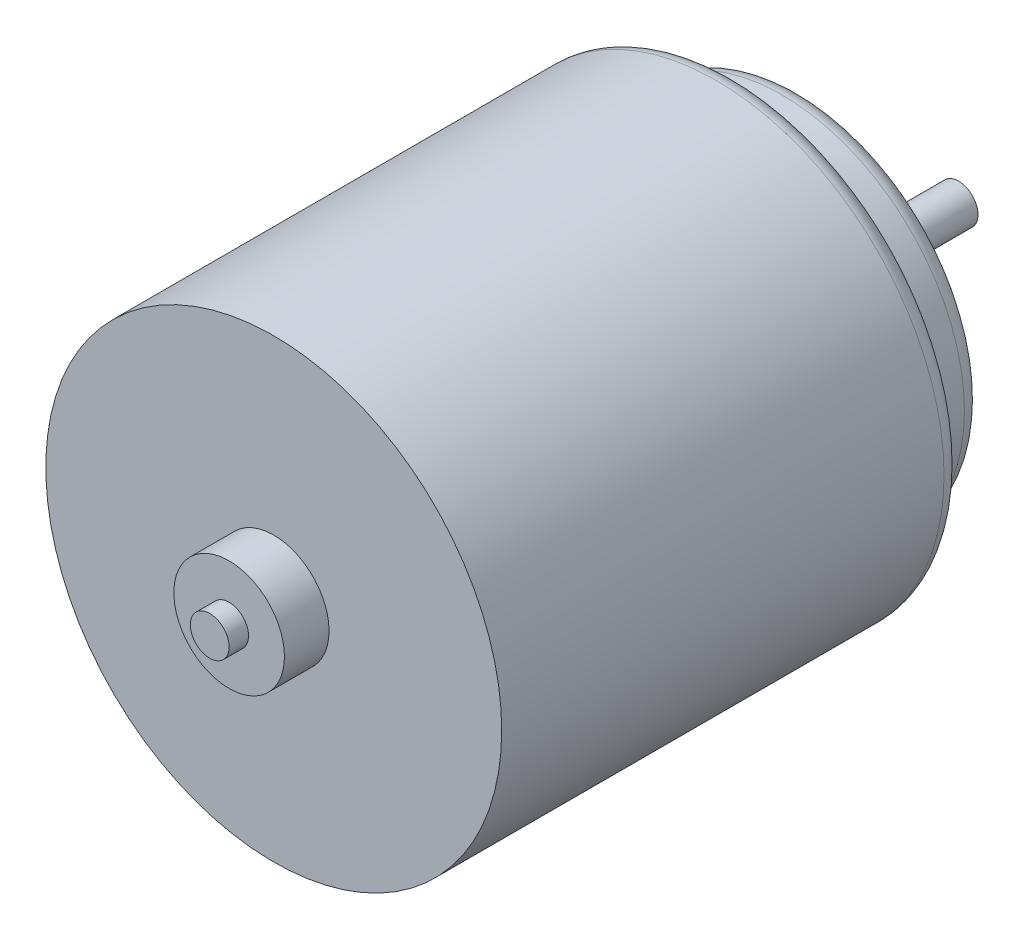
ISO-10303-21;
HEADER;
FILE_DESCRIPTION(('STEP AP214'),'2;1');
FILE_NAME('part.step','',(''),(''),'','','');
FILE_SCHEMA(('AUTOMOTIVE_DESIGN { 1 0 10303 214 1 1 1 1 }'));
ENDSEC;
DATA;
#1=APPLICATION_CONTEXT('core data for automotive mechanical design processes');
#2=APPLICATION_PROTOCOL_DEFINITION('international standard','automotive_design',2000,#1);
#3=PRODUCT_CONTEXT('',#1,'mechanical');
#4=PRODUCT('Part','Part','',(#3));
#5=PRODUCT_RELATED_PRODUCT_CATEGORY('part','',(#4));
#6=PRODUCT_DEFINITION_FORMATION('','',#4);
#7=PRODUCT_DEFINITION_CONTEXT('part definition',#1,'design');
#8=PRODUCT_DEFINITION('design','',#6,#7);
#9=PRODUCT_DEFINITION_SHAPE('','',#8);
#10=(LENGTH_UNIT() NAMED_UNIT(*) SI_UNIT(.MILLI.,.METRE.));
#11=(NAMED_UNIT(*) PLANE_ANGLE_UNIT() SI_UNIT($,.RADIAN.));
#12=(NAMED_UNIT(*) SI_UNIT($,.STERADIAN.) SOLID_ANGLE_UNIT());
#13=UNCERTAINTY_MEASURE_WITH_UNIT(LENGTH_MEASURE(1.E-05),#10,'distance_accuracy_value','');
#14=(GEOMETRIC_REPRESENTATION_CONTEXT(3) GLOBAL_UNCERTAINTY_ASSIGNED_CONTEXT((#13)) GLOBAL_UNIT_ASSIGNED_CONTEXT((#10,
#11,#12)) REPRESENTATION_CONTEXT('',''));
#15=CARTESIAN_POINT('',(0.,0.,0.));
#16=DIRECTION('',(0.,0.,1.));
#17=DIRECTION('',(1.,0.,0.));
#18=AXIS2_PLACEMENT_3D('',#15,#16,#17);
#19=CARTESIAN_POINT('',(0.,0.,-23.8));
#20=DIRECTION('',(0.,0.,1.));
#21=DIRECTION('',(1.,0.,0.));
#22=AXIS2_PLACEMENT_3D('',#19,#20,#21);
#23=CYLINDRICAL_SURFACE('',#22,11.75);
#24=CARTESIAN_POINT('',(0.,0.,-22.8));
#25=DIRECTION('',(0.,0.,1.));
#26=DIRECTION('',(1.,0.,0.));
#27=AXIS2_PLACEMENT_3D('',#24,#25,#26);
#28=CIRCLE('',#27,11.75);
#29=CARTESIAN_POINT('',(11.75,0.,-22.8));
#30=VERTEX_POINT('',#29);
#31=EDGE_CURVE('E42',#30,#30,#28,.T.);
#32=ORIENTED_EDGE('',*,*,#31,.T.);
#33=EDGE_LOOP('',(#32));
#34=FACE_BOUND('',#33,.T.);
#35=CARTESIAN_POINT('',(0.,0.,0.));
#36=DIRECTION('',(0.,0.,1.));
#37=DIRECTION('',(1.,0.,0.));
#38=AXIS2_PLACEMENT_3D('',#35,#36,#37);
#39=CIRCLE('',#38,11.75);
#40=CARTESIAN_POINT('',(11.75,0.,0.));
#41=VERTEX_POINT('',#40);
#42=EDGE_CURVE('E58',#41,#41,#39,.T.);
#43=ORIENTED_EDGE('',*,*,#42,.F.);
#44=EDGE_LOOP('',(#43));
#45=FACE_BOUND('',#44,.T.);
#46=ADVANCED_FACE('F35',(#34,#45),#23,.T.);
#47=CARTESIAN_POINT('',(0.,0.,-23.8));
#48=DIRECTION('',(0.,0.,1.));
#49=DIRECTION('',(1.,0.,0.));
#50=AXIS2_PLACEMENT_3D('',#47,#48,#49);
#51=PLANE('',#50);
#52=CARTESIAN_POINT('',(0.,0.,-23.8));
#53=DIRECTION('',(0.,0.,1.));
#54=DIRECTION('',(1.,0.,0.));
#55=AXIS2_PLACEMENT_3D('',#52,#53,#54);
#56=CIRCLE('',#55,10.75);
#57=CARTESIAN_POINT('',(10.75,0.,-23.8));
#58=VERTEX_POINT('',#57);
#59=EDGE_CURVE('E10',#58,#58,#56,.F.);
#60=ORIENTED_EDGE('',*,*,#59,.T.);
#61=EDGE_LOOP('',(#60));
#62=FACE_BOUND('',#61,.T.);
#63=CARTESIAN_POINT('',(0.,0.,-23.8));
#64=DIRECTION('',(0.,0.,1.));
#65=DIRECTION('',(1.,0.,0.));
#66=AXIS2_PLACEMENT_3D('',#63,#64,#65);
#67=CIRCLE('',#66,9.4);
#68=CARTESIAN_POINT('',(9.4,0.,-23.8));
#69=VERTEX_POINT('',#68);
#70=EDGE_CURVE('E61',#69,#69,#67,.T.);
#71=ORIENTED_EDGE('',*,*,#70,.T.);
#72=EDGE_LOOP('',(#71));
#73=FACE_BOUND('',#72,.T.);
#74=ADVANCED_FACE('F104',(#62,#73),#51,.F.);
#75=CARTESIAN_POINT('',(0.,0.,0.));
#76=DIRECTION('',(0.,0.,1.));
#77=DIRECTION('',(1.,0.,0.));
#78=AXIS2_PLACEMENT_3D('',#75,#76,#77);
#79=PLANE('',#78);
#80=ORIENTED_EDGE('',*,*,#42,.T.);
#81=EDGE_LOOP('',(#80));
#82=FACE_BOUND('',#81,.T.);
#83=CARTESIAN_POINT('',(0.,0.,0.));
#84=DIRECTION('',(0.,0.,1.));
#85=DIRECTION('',(1.,0.,0.));
#86=AXIS2_PLACEMENT_3D('',#83,#84,#85);
#87=CIRCLE('',#86,2.85);
#88=CARTESIAN_POINT('',(2.85,0.,0.));
#89=VERTEX_POINT('',#88);
#90=EDGE_CURVE('E68',#89,#89,#87,.T.);
#91=ORIENTED_EDGE('',*,*,#90,.F.);
#92=EDGE_LOOP('',(#91));
#93=FACE_BOUND('',#92,.T.);
#94=ADVANCED_FACE('F109',(#82,#93),#79,.T.);
#95=CARTESIAN_POINT('',(0.,0.,-27.2));
#96=DIRECTION('',(0.,0.,1.));
#97=DIRECTION('',(1.,0.,0.));
#98=AXIS2_PLACEMENT_3D('',#95,#96,#97);
#99=CYLINDRICAL_SURFACE('',#98,9.4);
#100=CARTESIAN_POINT('',(0.,0.,-26.2));
#101=DIRECTION('',(0.,0.,1.));
#102=DIRECTION('',(1.,0.,0.));
#103=AXIS2_PLACEMENT_3D('',#100,#101,#102);
#104=CIRCLE('',#103,9.4);
#105=CARTESIAN_POINT('',(9.4,0.,-26.2));
#106=VERTEX_POINT('',#105);
#107=EDGE_CURVE('E50',#106,#106,#104,.T.);
#108=ORIENTED_EDGE('',*,*,#107,.T.);
#109=EDGE_LOOP('',(#108));
#110=FACE_BOUND('',#109,.T.);
#111=ORIENTED_EDGE('',*,*,#70,.F.);
#112=EDGE_LOOP('',(#111));
#113=FACE_BOUND('',#112,.T.);
#114=ADVANCED_FACE('F126',(#110,#113),#99,.T.);
#115=CARTESIAN_POINT('',(0.,0.,-27.2));
#116=DIRECTION('',(0.,0.,1.));
#117=DIRECTION('',(1.,0.,0.));
#118=AXIS2_PLACEMENT_3D('',#115,#116,#117);
#119=PLANE('',#118);
#120=CARTESIAN_POINT('',(0.,0.,-27.2));
#121=DIRECTION('',(0.,0.,1.));
#122=DIRECTION('',(1.,0.,0.));
#123=AXIS2_PLACEMENT_3D('',#120,#121,#122);
#124=CIRCLE('',#123,8.4);
#125=CARTESIAN_POINT('',(8.4,0.,-27.2));
#126=VERTEX_POINT('',#125);
#127=EDGE_CURVE('E46',#126,#126,#124,.F.);
#128=ORIENTED_EDGE('',*,*,#127,.T.);
#129=EDGE_LOOP('',(#128));
#130=FACE_BOUND('',#129,.T.);
#131=CARTESIAN_POINT('',(0.,0.,-27.2));
#132=DIRECTION('',(0.,0.,1.));
#133=DIRECTION('',(1.,0.,0.));
#134=AXIS2_PLACEMENT_3D('',#131,#132,#133);
#135=CIRCLE('',#134,4.25);
#136=CARTESIAN_POINT('',(4.25,0.,-27.2));
#137=VERTEX_POINT('',#136);
#138=EDGE_CURVE('E64',#137,#137,#135,.T.);
#139=ORIENTED_EDGE('',*,*,#138,.T.);
#140=EDGE_LOOP('',(#139));
#141=FACE_BOUND('',#140,.T.);
#142=ADVANCED_FACE('F129',(#130,#141),#119,.F.);
#143=CARTESIAN_POINT('',(0.,0.,-29.4));
#144=DIRECTION('',(0.,0.,1.));
#145=DIRECTION('',(1.,0.,0.));
#146=AXIS2_PLACEMENT_3D('',#143,#144,#145);
#147=CYLINDRICAL_SURFACE('',#146,4.25);
#148=CARTESIAN_POINT('',(0.,0.,-29.4));
#149=DIRECTION('',(0.,0.,1.));
#150=DIRECTION('',(1.,0.,0.));
#151=AXIS2_PLACEMENT_3D('',#148,#149,#150);
#152=CIRCLE('',#151,4.25);
#153=CARTESIAN_POINT('',(4.25,0.,-29.4));
#154=VERTEX_POINT('',#153);
#155=EDGE_CURVE('E67',#154,#154,#152,.T.);
#156=ORIENTED_EDGE('',*,*,#155,.T.);
#157=EDGE_LOOP('',(#156));
#158=FACE_BOUND('',#157,.T.);
#159=ORIENTED_EDGE('',*,*,#138,.F.);
#160=EDGE_LOOP('',(#159));
#161=FACE_BOUND('',#160,.T.);
#162=ADVANCED_FACE('F137',(#158,#161),#147,.T.);
#163=CARTESIAN_POINT('',(0.,0.,-29.4));
#164=DIRECTION('',(0.,0.,1.));
#165=DIRECTION('',(1.,0.,0.));
#166=AXIS2_PLACEMENT_3D('',#163,#164,#165);
#167=PLANE('',#166);
#168=CARTESIAN_POINT('',(0.,0.,-29.4));
#169=DIRECTION('',(0.,0.,1.));
#170=DIRECTION('',(1.,0.,0.));
#171=AXIS2_PLACEMENT_3D('',#168,#169,#170);
#172=CIRCLE('',#171,1.);
#173=CARTESIAN_POINT('',(1.,0.,-29.4));
#174=VERTEX_POINT('',#173);
#175=EDGE_CURVE('E76',#174,#174,#172,.T.);
#176=ORIENTED_EDGE('',*,*,#175,.T.);
#177=EDGE_LOOP('',(#176));
#178=FACE_BOUND('',#177,.T.);
#179=ORIENTED_EDGE('',*,*,#155,.F.);
#180=EDGE_LOOP('',(#179));
#181=FACE_BOUND('',#180,.T.);
#182=ADVANCED_FACE('F144',(#178,#181),#167,.F.);
#183=CARTESIAN_POINT('',(0.,0.,-29.4));
#184=DIRECTION('',(0.,0.,1.));
#185=DIRECTION('',(1.,0.,0.));
#186=AXIS2_PLACEMENT_3D('',#183,#184,#185);
#187=CYLINDRICAL_SURFACE('',#186,2.85);
#188=ORIENTED_EDGE('',*,*,#90,.T.);
#189=EDGE_LOOP('',(#188));
#190=FACE_BOUND('',#189,.T.);
#191=CARTESIAN_POINT('',(0.,0.,2.3));
#192=DIRECTION('',(0.,0.,1.));
#193=DIRECTION('',(1.,0.,0.));
#194=AXIS2_PLACEMENT_3D('',#191,#192,#193);
#195=CIRCLE('',#194,2.85);
#196=CARTESIAN_POINT('',(2.85,0.,2.3));
#197=VERTEX_POINT('',#196);
#198=EDGE_CURVE('E71',#197,#197,#195,.T.);
#199=ORIENTED_EDGE('',*,*,#198,.F.);
#200=EDGE_LOOP('',(#199));
#201=FACE_BOUND('',#200,.T.);
#202=ADVANCED_FACE('F148',(#190,#201),#187,.T.);
#203=CARTESIAN_POINT('',(0.,0.,2.3));
#204=DIRECTION('',(0.,0.,1.));
#205=DIRECTION('',(1.,0.,0.));
#206=AXIS2_PLACEMENT_3D('',#203,#204,#205);
#207=PLANE('',#206);
#208=CARTESIAN_POINT('',(0.,0.,2.3));
#209=DIRECTION('',(0.,0.,1.));
#210=DIRECTION('',(1.,0.,0.));
#211=AXIS2_PLACEMENT_3D('',#208,#209,#210);
#212=CIRCLE('',#211,1.);
#213=CARTESIAN_POINT('',(1.,0.,2.3));
#214=VERTEX_POINT('',#213);
#215=EDGE_CURVE('E55',#214,#214,#212,.T.);
#216=ORIENTED_EDGE('',*,*,#215,.F.);
#217=EDGE_LOOP('',(#216));
#218=FACE_BOUND('',#217,.T.);
#219=ORIENTED_EDGE('',*,*,#198,.T.);
#220=EDGE_LOOP('',(#219));
#221=FACE_BOUND('',#220,.T.);
#222=ADVANCED_FACE('F99',(#218,#221),#207,.T.);
#223=CARTESIAN_POINT('',(0.,0.,3.29999999999999));
#224=DIRECTION('',(0.,0.,1.));
#225=DIRECTION('',(1.,0.,0.));
#226=AXIS2_PLACEMENT_3D('',#223,#224,#225);
#227=PLANE('',#226);
#228=CARTESIAN_POINT('',(0.,0.,3.29999999999999));
#229=DIRECTION('',(0.,0.,1.));
#230=DIRECTION('',(1.,0.,0.));
#231=AXIS2_PLACEMENT_3D('',#228,#229,#230);
#232=CIRCLE('',#231,1.);
#233=CARTESIAN_POINT('',(1.,0.,3.29999999999999));
#234=VERTEX_POINT('',#233);
#235=EDGE_CURVE('E82',#234,#234,#232,.T.);
#236=ORIENTED_EDGE('',*,*,#235,.T.);
#237=EDGE_LOOP('',(#236));
#238=FACE_BOUND('',#237,.T.);
#239=ADVANCED_FACE('F86',(#238),#227,.T.);
#240=CARTESIAN_POINT('',(0.,0.,-35.3));
#241=DIRECTION('',(0.,0.,1.));
#242=DIRECTION('',(1.,0.,0.));
#243=AXIS2_PLACEMENT_3D('',#240,#241,#242);
#244=CYLINDRICAL_SURFACE('',#243,1.);
#245=ORIENTED_EDGE('',*,*,#215,.T.);
#246=EDGE_LOOP('',(#245));
#247=FACE_BOUND('',#246,.T.);
#248=ORIENTED_EDGE('',*,*,#235,.F.);
#249=EDGE_LOOP('',(#248));
#250=FACE_BOUND('',#249,.T.);
#251=ADVANCED_FACE('F88',(#247,#250),#244,.T.);
#252=CARTESIAN_POINT('',(0.,0.,-35.3));
#253=DIRECTION('',(0.,0.,1.));
#254=DIRECTION('',(1.,0.,0.));
#255=AXIS2_PLACEMENT_3D('',#252,#253,#254);
#256=CIRCLE('',#255,1.);
#257=CARTESIAN_POINT('',(1.,0.,-35.3));
#258=VERTEX_POINT('',#257);
#259=EDGE_CURVE('E79',#258,#258,#256,.T.);
#260=ORIENTED_EDGE('',*,*,#259,.T.);
#261=EDGE_LOOP('',(#260));
#262=FACE_BOUND('',#261,.T.);
#263=ORIENTED_EDGE('',*,*,#175,.F.);
#264=EDGE_LOOP('',(#263));
#265=FACE_BOUND('',#264,.T.);
#266=ADVANCED_FACE('F90',(#262,#265),#244,.T.);
#267=CARTESIAN_POINT('',(0.,0.,-35.3));
#268=DIRECTION('',(0.,0.,1.));
#269=DIRECTION('',(1.,0.,0.));
#270=AXIS2_PLACEMENT_3D('',#267,#268,#269);
#271=PLANE('',#270);
#272=ORIENTED_EDGE('',*,*,#259,.F.);
#273=EDGE_LOOP('',(#272));
#274=FACE_BOUND('',#273,.T.);
#275=ADVANCED_FACE('F97',(#274),#271,.F.);
#276=CARTESIAN_POINT('',(0.,0.,-26.2));
#277=DIRECTION('',(0.,0.,1.));
#278=DIRECTION('',(1.,0.,0.));
#279=AXIS2_PLACEMENT_3D('',#276,#277,#278);
#280=TOROIDAL_SURFACE('',#279,8.4,1.);
#281=ORIENTED_EDGE('',*,*,#127,.F.);
#282=EDGE_LOOP('',(#281));
#283=FACE_BOUND('',#282,.T.);
#284=ORIENTED_EDGE('',*,*,#107,.F.);
#285=EDGE_LOOP('',(#284));
#286=FACE_BOUND('',#285,.T.);
#287=ADVANCED_FACE('F113',(#283,#286),#280,.T.);
#288=CARTESIAN_POINT('',(0.,0.,-22.8));
#289=DIRECTION('',(0.,0.,1.));
#290=DIRECTION('',(1.,0.,0.));
#291=AXIS2_PLACEMENT_3D('',#288,#289,#290);
#292=TOROIDAL_SURFACE('',#291,10.75,1.);
#293=ORIENTED_EDGE('',*,*,#59,.F.);
#294=EDGE_LOOP('',(#293));
#295=FACE_BOUND('',#294,.T.);
#296=ORIENTED_EDGE('',*,*,#31,.F.);
#297=EDGE_LOOP('',(#296));
#298=FACE_BOUND('',#297,.T.);
#299=ADVANCED_FACE('F37',(#295,#298),#292,.T.);
#300=CLOSED_SHELL('',(#46,#74,#94,#114,#142,#162,#182,#202,#222,#239,#251,#266,#275,#287,#299));
#301=MANIFOLD_SOLID_BREP('B2',#300);
#302=ADVANCED_BREP_SHAPE_REPRESENTATION('',(#18,#301),#14);
#303=SHAPE_DEFINITION_REPRESENTATION(#9,#302);
ENDSEC;
END-ISO-10303-21;
